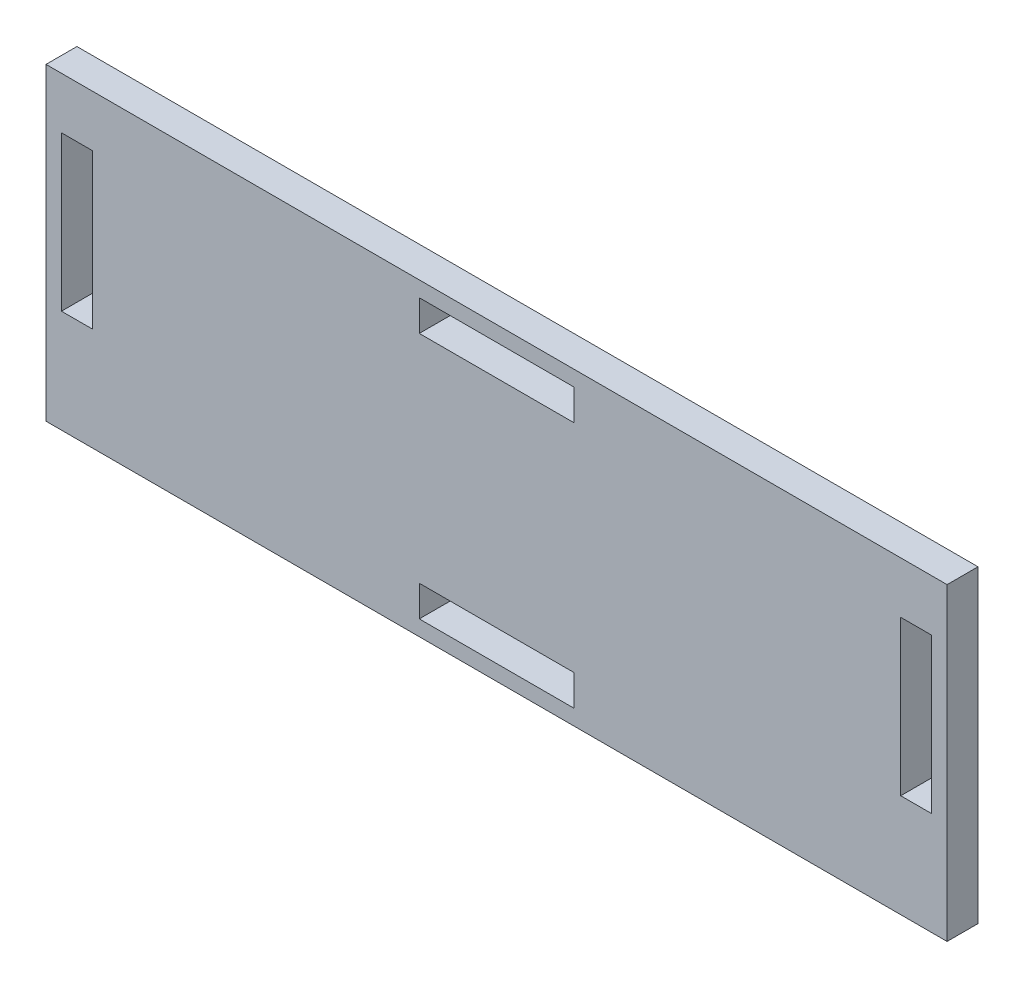
ISO-10303-21;
HEADER;
FILE_DESCRIPTION(('STEP AP214'),'2;1');
FILE_NAME('part.step','',(''),(''),'','','');
FILE_SCHEMA(('AUTOMOTIVE_DESIGN { 1 0 10303 214 1 1 1 1 }'));
ENDSEC;
DATA;
#1=APPLICATION_CONTEXT('core data for automotive mechanical design processes');
#2=APPLICATION_PROTOCOL_DEFINITION('international standard','automotive_design',2000,#1);
#3=PRODUCT_CONTEXT('',#1,'mechanical');
#4=PRODUCT('Part','Part','',(#3));
#5=PRODUCT_RELATED_PRODUCT_CATEGORY('part','',(#4));
#6=PRODUCT_DEFINITION_FORMATION('','',#4);
#7=PRODUCT_DEFINITION_CONTEXT('part definition',#1,'design');
#8=PRODUCT_DEFINITION('design','',#6,#7);
#9=PRODUCT_DEFINITION_SHAPE('','',#8);
#10=(LENGTH_UNIT() NAMED_UNIT(*) SI_UNIT(.MILLI.,.METRE.));
#11=(NAMED_UNIT(*) PLANE_ANGLE_UNIT() SI_UNIT($,.RADIAN.));
#12=(NAMED_UNIT(*) SI_UNIT($,.STERADIAN.) SOLID_ANGLE_UNIT());
#13=UNCERTAINTY_MEASURE_WITH_UNIT(LENGTH_MEASURE(1.E-05),#10,'distance_accuracy_value','');
#14=(GEOMETRIC_REPRESENTATION_CONTEXT(3) GLOBAL_UNCERTAINTY_ASSIGNED_CONTEXT((#13)) GLOBAL_UNIT_ASSIGNED_CONTEXT((#10,
#11,#12)) REPRESENTATION_CONTEXT('',''));
#15=CARTESIAN_POINT('',(0.,0.,0.));
#16=DIRECTION('',(0.,0.,1.));
#17=DIRECTION('',(1.,0.,0.));
#18=AXIS2_PLACEMENT_3D('',#15,#16,#17);
#19=CARTESIAN_POINT('',(0.,0.,3.));
#20=DIRECTION('',(1.,0.,0.));
#21=DIRECTION('',(0.,0.,-1.));
#22=AXIS2_PLACEMENT_3D('',#19,#20,#21);
#23=PLANE('',#22);
#24=DIRECTION('',(0.,-1.,0.));
#25=VECTOR('',#24,1.);
#26=CARTESIAN_POINT('',(0.,0.,0.));
#27=LINE('',#26,#25);
#28=CARTESIAN_POINT('',(0.,30.,0.));
#29=VERTEX_POINT('',#28);
#30=CARTESIAN_POINT('',(0.,0.,0.));
#31=VERTEX_POINT('',#30);
#32=EDGE_CURVE('E295',#29,#31,#27,.T.);
#33=ORIENTED_EDGE('',*,*,#32,.T.);
#34=DIRECTION('',(0.,0.,-1.));
#35=VECTOR('',#34,1.);
#36=CARTESIAN_POINT('',(0.,0.,3.));
#37=LINE('',#36,#35);
#38=CARTESIAN_POINT('',(0.,0.,3.));
#39=VERTEX_POINT('',#38);
#40=EDGE_CURVE('E11',#39,#31,#37,.T.);
#41=ORIENTED_EDGE('',*,*,#40,.F.);
#42=DIRECTION('',(0.,-1.,0.));
#43=VECTOR('',#42,1.);
#44=CARTESIAN_POINT('',(0.,0.,3.));
#45=LINE('',#44,#43);
#46=CARTESIAN_POINT('',(0.,30.,3.));
#47=VERTEX_POINT('',#46);
#48=EDGE_CURVE('E302',#47,#39,#45,.T.);
#49=ORIENTED_EDGE('',*,*,#48,.F.);
#50=DIRECTION('',(0.,0.,-1.));
#51=VECTOR('',#50,1.);
#52=CARTESIAN_POINT('',(0.,30.,3.));
#53=LINE('',#52,#51);
#54=EDGE_CURVE('E312',#47,#29,#53,.T.);
#55=ORIENTED_EDGE('',*,*,#54,.T.);
#56=EDGE_LOOP('',(#33,#41,#49,#55));
#57=FACE_BOUND('',#56,.T.);
#58=ADVANCED_FACE('F33',(#57),#23,.F.);
#59=CARTESIAN_POINT('',(0.,0.,3.));
#60=DIRECTION('',(0.,1.,0.));
#61=DIRECTION('',(0.,0.,1.));
#62=AXIS2_PLACEMENT_3D('',#59,#60,#61);
#63=PLANE('',#62);
#64=DIRECTION('',(1.,0.,0.));
#65=VECTOR('',#64,1.);
#66=CARTESIAN_POINT('',(0.,0.,0.));
#67=LINE('',#66,#65);
#68=CARTESIAN_POINT('',(87.47,0.,0.));
#69=VERTEX_POINT('',#68);
#70=EDGE_CURVE('E315',#31,#69,#67,.T.);
#71=ORIENTED_EDGE('',*,*,#70,.T.);
#72=DIRECTION('',(0.,0.,-1.));
#73=VECTOR('',#72,1.);
#74=CARTESIAN_POINT('',(87.47,0.,3.));
#75=LINE('',#74,#73);
#76=CARTESIAN_POINT('',(87.47,0.,3.));
#77=VERTEX_POINT('',#76);
#78=EDGE_CURVE('E40',#77,#69,#75,.T.);
#79=ORIENTED_EDGE('',*,*,#78,.F.);
#80=DIRECTION('',(1.,0.,0.));
#81=VECTOR('',#80,1.);
#82=CARTESIAN_POINT('',(0.,0.,3.));
#83=LINE('',#82,#81);
#84=EDGE_CURVE('E305',#39,#77,#83,.T.);
#85=ORIENTED_EDGE('',*,*,#84,.F.);
#86=ORIENTED_EDGE('',*,*,#40,.T.);
#87=EDGE_LOOP('',(#71,#79,#85,#86));
#88=FACE_BOUND('',#87,.T.);
#89=ADVANCED_FACE('F344',(#88),#63,.F.);
#90=CARTESIAN_POINT('',(87.47,0.,3.));
#91=DIRECTION('',(-1.,0.,0.));
#92=DIRECTION('',(0.,0.,1.));
#93=AXIS2_PLACEMENT_3D('',#90,#91,#92);
#94=PLANE('',#93);
#95=DIRECTION('',(0.,1.,0.));
#96=VECTOR('',#95,1.);
#97=CARTESIAN_POINT('',(87.47,0.,0.));
#98=LINE('',#97,#96);
#99=CARTESIAN_POINT('',(87.47,30.,0.));
#100=VERTEX_POINT('',#99);
#101=EDGE_CURVE('E317',#69,#100,#98,.T.);
#102=ORIENTED_EDGE('',*,*,#101,.T.);
#103=DIRECTION('',(0.,0.,-1.));
#104=VECTOR('',#103,1.);
#105=CARTESIAN_POINT('',(87.47,30.,3.));
#106=LINE('',#105,#104);
#107=CARTESIAN_POINT('',(87.47,30.,3.));
#108=VERTEX_POINT('',#107);
#109=EDGE_CURVE('E322',#108,#100,#106,.T.);
#110=ORIENTED_EDGE('',*,*,#109,.F.);
#111=DIRECTION('',(0.,1.,0.));
#112=VECTOR('',#111,1.);
#113=CARTESIAN_POINT('',(87.47,0.,3.));
#114=LINE('',#113,#112);
#115=EDGE_CURVE('E308',#77,#108,#114,.T.);
#116=ORIENTED_EDGE('',*,*,#115,.F.);
#117=ORIENTED_EDGE('',*,*,#78,.T.);
#118=EDGE_LOOP('',(#102,#110,#116,#117));
#119=FACE_BOUND('',#118,.T.);
#120=ADVANCED_FACE('F329',(#119),#94,.F.);
#121=CARTESIAN_POINT('',(0.,30.,3.));
#122=DIRECTION('',(0.,-1.,0.));
#123=DIRECTION('',(0.,0.,-1.));
#124=AXIS2_PLACEMENT_3D('',#121,#122,#123);
#125=PLANE('',#124);
#126=DIRECTION('',(-1.,0.,0.));
#127=VECTOR('',#126,1.);
#128=CARTESIAN_POINT('',(0.,30.,0.));
#129=LINE('',#128,#127);
#130=EDGE_CURVE('E306',#100,#29,#129,.T.);
#131=ORIENTED_EDGE('',*,*,#130,.T.);
#132=ORIENTED_EDGE('',*,*,#54,.F.);
#133=DIRECTION('',(-1.,0.,0.));
#134=VECTOR('',#133,1.);
#135=CARTESIAN_POINT('',(0.,30.,3.));
#136=LINE('',#135,#134);
#137=EDGE_CURVE('E310',#108,#47,#136,.T.);
#138=ORIENTED_EDGE('',*,*,#137,.F.);
#139=ORIENTED_EDGE('',*,*,#109,.T.);
#140=EDGE_LOOP('',(#131,#132,#138,#139));
#141=FACE_BOUND('',#140,.T.);
#142=ADVANCED_FACE('F337',(#141),#125,.F.);
#143=CARTESIAN_POINT('',(0.,0.,3.));
#144=DIRECTION('',(0.,0.,-1.));
#145=DIRECTION('',(-1.,0.,0.));
#146=AXIS2_PLACEMENT_3D('',#143,#144,#145);
#147=PLANE('',#146);
#148=DIRECTION('',(1.,0.,0.));
#149=VECTOR('',#148,1.);
#150=CARTESIAN_POINT('',(82.97,10.,3.));
#151=LINE('',#150,#149);
#152=CARTESIAN_POINT('',(82.97,10.,3.));
#153=VERTEX_POINT('',#152);
#154=CARTESIAN_POINT('',(85.97,10.,3.));
#155=VERTEX_POINT('',#154);
#156=EDGE_CURVE('E196',#153,#155,#151,.T.);
#157=ORIENTED_EDGE('',*,*,#156,.F.);
#158=DIRECTION('',(0.,-1.,0.));
#159=VECTOR('',#158,1.);
#160=CARTESIAN_POINT('',(82.97,25.,3.));
#161=LINE('',#160,#159);
#162=CARTESIAN_POINT('',(82.97,25.,3.));
#163=VERTEX_POINT('',#162);
#164=EDGE_CURVE('E47',#163,#153,#161,.T.);
#165=ORIENTED_EDGE('',*,*,#164,.F.);
#166=DIRECTION('',(-1.,0.,0.));
#167=VECTOR('',#166,1.);
#168=CARTESIAN_POINT('',(82.97,25.,3.));
#169=LINE('',#168,#167);
#170=CARTESIAN_POINT('',(85.97,25.,3.));
#171=VERTEX_POINT('',#170);
#172=EDGE_CURVE('E187',#171,#163,#169,.T.);
#173=ORIENTED_EDGE('',*,*,#172,.F.);
#174=DIRECTION('',(0.,1.,0.));
#175=VECTOR('',#174,1.);
#176=CARTESIAN_POINT('',(85.97,25.,3.));
#177=LINE('',#176,#175);
#178=EDGE_CURVE('E190',#155,#171,#177,.T.);
#179=ORIENTED_EDGE('',*,*,#178,.F.);
#180=EDGE_LOOP('',(#157,#165,#173,#179));
#181=FACE_BOUND('',#180,.T.);
#182=DIRECTION('',(1.,0.,0.));
#183=VECTOR('',#182,1.);
#184=CARTESIAN_POINT('',(1.5,10.,3.));
#185=LINE('',#184,#183);
#186=CARTESIAN_POINT('',(1.5,10.,3.));
#187=VERTEX_POINT('',#186);
#188=CARTESIAN_POINT('',(4.5,10.,3.));
#189=VERTEX_POINT('',#188);
#190=EDGE_CURVE('E221',#187,#189,#185,.T.);
#191=ORIENTED_EDGE('',*,*,#190,.F.);
#192=DIRECTION('',(0.,-1.,0.));
#193=VECTOR('',#192,1.);
#194=CARTESIAN_POINT('',(1.5,25.,3.));
#195=LINE('',#194,#193);
#196=CARTESIAN_POINT('',(1.5,25.,3.));
#197=VERTEX_POINT('',#196);
#198=EDGE_CURVE('E202',#197,#187,#195,.T.);
#199=ORIENTED_EDGE('',*,*,#198,.F.);
#200=DIRECTION('',(-1.,0.,0.));
#201=VECTOR('',#200,1.);
#202=CARTESIAN_POINT('',(1.5,25.,3.));
#203=LINE('',#202,#201);
#204=CARTESIAN_POINT('',(4.5,25.,3.));
#205=VERTEX_POINT('',#204);
#206=EDGE_CURVE('E210',#205,#197,#203,.T.);
#207=ORIENTED_EDGE('',*,*,#206,.F.);
#208=DIRECTION('',(0.,1.,0.));
#209=VECTOR('',#208,1.);
#210=CARTESIAN_POINT('',(4.5,25.,3.));
#211=LINE('',#210,#209);
#212=EDGE_CURVE('E224',#189,#205,#211,.T.);
#213=ORIENTED_EDGE('',*,*,#212,.F.);
#214=EDGE_LOOP('',(#191,#199,#207,#213));
#215=FACE_BOUND('',#214,.T.);
#216=DIRECTION('',(1.,0.,0.));
#217=VECTOR('',#216,1.);
#218=CARTESIAN_POINT('',(36.235,1.5,3.));
#219=LINE('',#218,#217);
#220=CARTESIAN_POINT('',(36.235,1.5,3.));
#221=VERTEX_POINT('',#220);
#222=CARTESIAN_POINT('',(51.235,1.5,3.));
#223=VERTEX_POINT('',#222);
#224=EDGE_CURVE('E253',#221,#223,#219,.T.);
#225=ORIENTED_EDGE('',*,*,#224,.F.);
#226=DIRECTION('',(0.,-1.,0.));
#227=VECTOR('',#226,1.);
#228=CARTESIAN_POINT('',(36.235,4.5,3.));
#229=LINE('',#228,#227);
#230=CARTESIAN_POINT('',(36.235,4.5,3.));
#231=VERTEX_POINT('',#230);
#232=EDGE_CURVE('E231',#231,#221,#229,.T.);
#233=ORIENTED_EDGE('',*,*,#232,.F.);
#234=DIRECTION('',(-1.,0.,0.));
#235=VECTOR('',#234,1.);
#236=CARTESIAN_POINT('',(36.235,4.5,3.));
#237=LINE('',#236,#235);
#238=CARTESIAN_POINT('',(51.235,4.5,3.));
#239=VERTEX_POINT('',#238);
#240=EDGE_CURVE('E242',#239,#231,#237,.T.);
#241=ORIENTED_EDGE('',*,*,#240,.F.);
#242=DIRECTION('',(0.,1.,0.));
#243=VECTOR('',#242,1.);
#244=CARTESIAN_POINT('',(51.235,4.5,3.));
#245=LINE('',#244,#243);
#246=EDGE_CURVE('E256',#223,#239,#245,.T.);
#247=ORIENTED_EDGE('',*,*,#246,.F.);
#248=EDGE_LOOP('',(#225,#233,#241,#247));
#249=FACE_BOUND('',#248,.T.);
#250=DIRECTION('',(1.,0.,0.));
#251=VECTOR('',#250,1.);
#252=CARTESIAN_POINT('',(36.235,25.5,3.));
#253=LINE('',#252,#251);
#254=CARTESIAN_POINT('',(36.235,25.5,3.));
#255=VERTEX_POINT('',#254);
#256=CARTESIAN_POINT('',(51.235,25.5,3.));
#257=VERTEX_POINT('',#256);
#258=EDGE_CURVE('E285',#255,#257,#253,.T.);
#259=ORIENTED_EDGE('',*,*,#258,.F.);
#260=DIRECTION('',(0.,-1.,0.));
#261=VECTOR('',#260,1.);
#262=CARTESIAN_POINT('',(36.235,28.5,3.));
#263=LINE('',#262,#261);
#264=CARTESIAN_POINT('',(36.235,28.5,3.));
#265=VERTEX_POINT('',#264);
#266=EDGE_CURVE('E263',#265,#255,#263,.T.);
#267=ORIENTED_EDGE('',*,*,#266,.F.);
#268=DIRECTION('',(-1.,0.,0.));
#269=VECTOR('',#268,1.);
#270=CARTESIAN_POINT('',(36.235,28.5,3.));
#271=LINE('',#270,#269);
#272=CARTESIAN_POINT('',(51.235,28.5,3.));
#273=VERTEX_POINT('',#272);
#274=EDGE_CURVE('E274',#273,#265,#271,.T.);
#275=ORIENTED_EDGE('',*,*,#274,.F.);
#276=DIRECTION('',(0.,1.,0.));
#277=VECTOR('',#276,1.);
#278=CARTESIAN_POINT('',(51.235,28.5,3.));
#279=LINE('',#278,#277);
#280=EDGE_CURVE('E288',#257,#273,#279,.T.);
#281=ORIENTED_EDGE('',*,*,#280,.F.);
#282=EDGE_LOOP('',(#259,#267,#275,#281));
#283=FACE_BOUND('',#282,.T.);
#284=ORIENTED_EDGE('',*,*,#48,.T.);
#285=ORIENTED_EDGE('',*,*,#84,.T.);
#286=ORIENTED_EDGE('',*,*,#115,.T.);
#287=ORIENTED_EDGE('',*,*,#137,.T.);
#288=EDGE_LOOP('',(#284,#285,#286,#287));
#289=FACE_BOUND('',#288,.T.);
#290=ADVANCED_FACE('F343',(#181,#215,#249,#283,#289),#147,.F.);
#291=CARTESIAN_POINT('',(0.,0.,0.));
#292=DIRECTION('',(0.,0.,-1.));
#293=DIRECTION('',(-1.,0.,0.));
#294=AXIS2_PLACEMENT_3D('',#291,#292,#293);
#295=PLANE('',#294);
#296=DIRECTION('',(0.,-1.,0.));
#297=VECTOR('',#296,1.);
#298=CARTESIAN_POINT('',(82.97,25.,0.));
#299=LINE('',#298,#297);
#300=CARTESIAN_POINT('',(82.97,25.,0.));
#301=VERTEX_POINT('',#300);
#302=CARTESIAN_POINT('',(82.97,10.,0.));
#303=VERTEX_POINT('',#302);
#304=EDGE_CURVE('E171',#301,#303,#299,.T.);
#305=ORIENTED_EDGE('',*,*,#304,.T.);
#306=DIRECTION('',(1.,0.,0.));
#307=VECTOR('',#306,1.);
#308=CARTESIAN_POINT('',(82.97,10.,0.));
#309=LINE('',#308,#307);
#310=CARTESIAN_POINT('',(85.97,10.,0.));
#311=VERTEX_POINT('',#310);
#312=EDGE_CURVE('E180',#303,#311,#309,.T.);
#313=ORIENTED_EDGE('',*,*,#312,.T.);
#314=DIRECTION('',(0.,1.,0.));
#315=VECTOR('',#314,1.);
#316=CARTESIAN_POINT('',(85.97,25.,0.));
#317=LINE('',#316,#315);
#318=CARTESIAN_POINT('',(85.97,25.,0.));
#319=VERTEX_POINT('',#318);
#320=EDGE_CURVE('E55',#311,#319,#317,.T.);
#321=ORIENTED_EDGE('',*,*,#320,.T.);
#322=DIRECTION('',(-1.,0.,0.));
#323=VECTOR('',#322,1.);
#324=CARTESIAN_POINT('',(82.97,25.,0.));
#325=LINE('',#324,#323);
#326=EDGE_CURVE('E177',#319,#301,#325,.T.);
#327=ORIENTED_EDGE('',*,*,#326,.T.);
#328=EDGE_LOOP('',(#305,#313,#321,#327));
#329=FACE_BOUND('',#328,.T.);
#330=DIRECTION('',(0.,-1.,0.));
#331=VECTOR('',#330,1.);
#332=CARTESIAN_POINT('',(1.5,25.,0.));
#333=LINE('',#332,#331);
#334=CARTESIAN_POINT('',(1.5,25.,0.));
#335=VERTEX_POINT('',#334);
#336=CARTESIAN_POINT('',(1.5,10.,0.));
#337=VERTEX_POINT('',#336);
#338=EDGE_CURVE('E206',#335,#337,#333,.T.);
#339=ORIENTED_EDGE('',*,*,#338,.T.);
#340=DIRECTION('',(1.,0.,0.));
#341=VECTOR('',#340,1.);
#342=CARTESIAN_POINT('',(1.5,10.,0.));
#343=LINE('',#342,#341);
#344=CARTESIAN_POINT('',(4.5,10.,0.));
#345=VERTEX_POINT('',#344);
#346=EDGE_CURVE('E209',#337,#345,#343,.T.);
#347=ORIENTED_EDGE('',*,*,#346,.T.);
#348=DIRECTION('',(0.,1.,0.));
#349=VECTOR('',#348,1.);
#350=CARTESIAN_POINT('',(4.5,25.,0.));
#351=LINE('',#350,#349);
#352=CARTESIAN_POINT('',(4.5,25.,0.));
#353=VERTEX_POINT('',#352);
#354=EDGE_CURVE('E213',#345,#353,#351,.T.);
#355=ORIENTED_EDGE('',*,*,#354,.T.);
#356=DIRECTION('',(-1.,0.,0.));
#357=VECTOR('',#356,1.);
#358=CARTESIAN_POINT('',(1.5,25.,0.));
#359=LINE('',#358,#357);
#360=EDGE_CURVE('E216',#353,#335,#359,.T.);
#361=ORIENTED_EDGE('',*,*,#360,.T.);
#362=EDGE_LOOP('',(#339,#347,#355,#361));
#363=FACE_BOUND('',#362,.T.);
#364=DIRECTION('',(0.,-1.,0.));
#365=VECTOR('',#364,1.);
#366=CARTESIAN_POINT('',(36.235,4.5,0.));
#367=LINE('',#366,#365);
#368=CARTESIAN_POINT('',(36.235,4.5,0.));
#369=VERTEX_POINT('',#368);
#370=CARTESIAN_POINT('',(36.235,1.5,0.));
#371=VERTEX_POINT('',#370);
#372=EDGE_CURVE('E238',#369,#371,#367,.T.);
#373=ORIENTED_EDGE('',*,*,#372,.T.);
#374=DIRECTION('',(1.,0.,0.));
#375=VECTOR('',#374,1.);
#376=CARTESIAN_POINT('',(36.235,1.5,0.));
#377=LINE('',#376,#375);
#378=CARTESIAN_POINT('',(51.235,1.5,0.));
#379=VERTEX_POINT('',#378);
#380=EDGE_CURVE('E241',#371,#379,#377,.T.);
#381=ORIENTED_EDGE('',*,*,#380,.T.);
#382=DIRECTION('',(0.,1.,0.));
#383=VECTOR('',#382,1.);
#384=CARTESIAN_POINT('',(51.235,4.5,0.));
#385=LINE('',#384,#383);
#386=CARTESIAN_POINT('',(51.235,4.5,0.));
#387=VERTEX_POINT('',#386);
#388=EDGE_CURVE('E245',#379,#387,#385,.T.);
#389=ORIENTED_EDGE('',*,*,#388,.T.);
#390=DIRECTION('',(-1.,0.,0.));
#391=VECTOR('',#390,1.);
#392=CARTESIAN_POINT('',(36.235,4.5,0.));
#393=LINE('',#392,#391);
#394=EDGE_CURVE('E248',#387,#369,#393,.T.);
#395=ORIENTED_EDGE('',*,*,#394,.T.);
#396=EDGE_LOOP('',(#373,#381,#389,#395));
#397=FACE_BOUND('',#396,.T.);
#398=DIRECTION('',(0.,-1.,0.));
#399=VECTOR('',#398,1.);
#400=CARTESIAN_POINT('',(36.235,28.5,0.));
#401=LINE('',#400,#399);
#402=CARTESIAN_POINT('',(36.235,28.5,0.));
#403=VERTEX_POINT('',#402);
#404=CARTESIAN_POINT('',(36.235,25.5,0.));
#405=VERTEX_POINT('',#404);
#406=EDGE_CURVE('E270',#403,#405,#401,.T.);
#407=ORIENTED_EDGE('',*,*,#406,.T.);
#408=DIRECTION('',(1.,0.,0.));
#409=VECTOR('',#408,1.);
#410=CARTESIAN_POINT('',(36.235,25.5,0.));
#411=LINE('',#410,#409);
#412=CARTESIAN_POINT('',(51.235,25.5,0.));
#413=VERTEX_POINT('',#412);
#414=EDGE_CURVE('E273',#405,#413,#411,.T.);
#415=ORIENTED_EDGE('',*,*,#414,.T.);
#416=DIRECTION('',(0.,1.,0.));
#417=VECTOR('',#416,1.);
#418=CARTESIAN_POINT('',(51.235,28.5,0.));
#419=LINE('',#418,#417);
#420=CARTESIAN_POINT('',(51.235,28.5,0.));
#421=VERTEX_POINT('',#420);
#422=EDGE_CURVE('E277',#413,#421,#419,.T.);
#423=ORIENTED_EDGE('',*,*,#422,.T.);
#424=DIRECTION('',(-1.,0.,0.));
#425=VECTOR('',#424,1.);
#426=CARTESIAN_POINT('',(36.235,28.5,0.));
#427=LINE('',#426,#425);
#428=EDGE_CURVE('E280',#421,#403,#427,.T.);
#429=ORIENTED_EDGE('',*,*,#428,.T.);
#430=EDGE_LOOP('',(#407,#415,#423,#429));
#431=FACE_BOUND('',#430,.T.);
#432=ORIENTED_EDGE('',*,*,#32,.F.);
#433=ORIENTED_EDGE('',*,*,#130,.F.);
#434=ORIENTED_EDGE('',*,*,#101,.F.);
#435=ORIENTED_EDGE('',*,*,#70,.F.);
#436=EDGE_LOOP('',(#432,#433,#434,#435));
#437=FACE_BOUND('',#436,.T.);
#438=ADVANCED_FACE('F184',(#329,#363,#397,#431,#437),#295,.T.);
#439=CARTESIAN_POINT('',(36.235,28.5,0.));
#440=DIRECTION('',(-1.,0.,0.));
#441=DIRECTION('',(0.,0.,1.));
#442=AXIS2_PLACEMENT_3D('',#439,#440,#441);
#443=PLANE('',#442);
#444=ORIENTED_EDGE('',*,*,#266,.T.);
#445=DIRECTION('',(0.,0.,1.));
#446=VECTOR('',#445,1.);
#447=CARTESIAN_POINT('',(36.235,25.5,0.));
#448=LINE('',#447,#446);
#449=EDGE_CURVE('E283',#405,#255,#448,.T.);
#450=ORIENTED_EDGE('',*,*,#449,.F.);
#451=ORIENTED_EDGE('',*,*,#406,.F.);
#452=DIRECTION('',(0.,0.,1.));
#453=VECTOR('',#452,1.);
#454=CARTESIAN_POINT('',(36.235,28.5,0.));
#455=LINE('',#454,#453);
#456=EDGE_CURVE('E293',#403,#265,#455,.T.);
#457=ORIENTED_EDGE('',*,*,#456,.T.);
#458=EDGE_LOOP('',(#444,#450,#451,#457));
#459=FACE_BOUND('',#458,.T.);
#460=ADVANCED_FACE('F356',(#459),#443,.F.);
#461=CARTESIAN_POINT('',(36.235,28.5,0.));
#462=DIRECTION('',(0.,1.,0.));
#463=DIRECTION('',(-1.,0.,0.));
#464=AXIS2_PLACEMENT_3D('',#461,#462,#463);
#465=PLANE('',#464);
#466=ORIENTED_EDGE('',*,*,#274,.T.);
#467=ORIENTED_EDGE('',*,*,#456,.F.);
#468=ORIENTED_EDGE('',*,*,#428,.F.);
#469=DIRECTION('',(0.,0.,1.));
#470=VECTOR('',#469,1.);
#471=CARTESIAN_POINT('',(51.235,28.5,0.));
#472=LINE('',#471,#470);
#473=EDGE_CURVE('E296',#421,#273,#472,.T.);
#474=ORIENTED_EDGE('',*,*,#473,.T.);
#475=EDGE_LOOP('',(#466,#467,#468,#474));
#476=FACE_BOUND('',#475,.T.);
#477=ADVANCED_FACE('F362',(#476),#465,.F.);
#478=CARTESIAN_POINT('',(51.235,28.5,0.));
#479=DIRECTION('',(1.,0.,0.));
#480=DIRECTION('',(0.,0.,-1.));
#481=AXIS2_PLACEMENT_3D('',#478,#479,#480);
#482=PLANE('',#481);
#483=ORIENTED_EDGE('',*,*,#280,.T.);
#484=ORIENTED_EDGE('',*,*,#473,.F.);
#485=ORIENTED_EDGE('',*,*,#422,.F.);
#486=DIRECTION('',(0.,0.,1.));
#487=VECTOR('',#486,1.);
#488=CARTESIAN_POINT('',(51.235,25.5,0.));
#489=LINE('',#488,#487);
#490=EDGE_CURVE('E298',#413,#257,#489,.T.);
#491=ORIENTED_EDGE('',*,*,#490,.T.);
#492=EDGE_LOOP('',(#483,#484,#485,#491));
#493=FACE_BOUND('',#492,.T.);
#494=ADVANCED_FACE('F368',(#493),#482,.F.);
#495=CARTESIAN_POINT('',(36.235,25.5,0.));
#496=DIRECTION('',(0.,-1.,0.));
#497=DIRECTION('',(0.,0.,-1.));
#498=AXIS2_PLACEMENT_3D('',#495,#496,#497);
#499=PLANE('',#498);
#500=ORIENTED_EDGE('',*,*,#258,.T.);
#501=ORIENTED_EDGE('',*,*,#490,.F.);
#502=ORIENTED_EDGE('',*,*,#414,.F.);
#503=ORIENTED_EDGE('',*,*,#449,.T.);
#504=EDGE_LOOP('',(#500,#501,#502,#503));
#505=FACE_BOUND('',#504,.T.);
#506=ADVANCED_FACE('F364',(#505),#499,.F.);
#507=CARTESIAN_POINT('',(36.235,4.5,0.));
#508=DIRECTION('',(-1.,0.,0.));
#509=DIRECTION('',(0.,0.,1.));
#510=AXIS2_PLACEMENT_3D('',#507,#508,#509);
#511=PLANE('',#510);
#512=ORIENTED_EDGE('',*,*,#232,.T.);
#513=DIRECTION('',(0.,0.,1.));
#514=VECTOR('',#513,1.);
#515=CARTESIAN_POINT('',(36.235,1.5,0.));
#516=LINE('',#515,#514);
#517=EDGE_CURVE('E251',#371,#221,#516,.T.);
#518=ORIENTED_EDGE('',*,*,#517,.F.);
#519=ORIENTED_EDGE('',*,*,#372,.F.);
#520=DIRECTION('',(0.,0.,1.));
#521=VECTOR('',#520,1.);
#522=CARTESIAN_POINT('',(36.235,4.5,0.));
#523=LINE('',#522,#521);
#524=EDGE_CURVE('E261',#369,#231,#523,.T.);
#525=ORIENTED_EDGE('',*,*,#524,.T.);
#526=EDGE_LOOP('',(#512,#518,#519,#525));
#527=FACE_BOUND('',#526,.T.);
#528=ADVANCED_FACE('F367',(#527),#511,.F.);
#529=CARTESIAN_POINT('',(36.235,4.5,0.));
#530=DIRECTION('',(0.,1.,0.));
#531=DIRECTION('',(-1.,0.,0.));
#532=AXIS2_PLACEMENT_3D('',#529,#530,#531);
#533=PLANE('',#532);
#534=ORIENTED_EDGE('',*,*,#240,.T.);
#535=ORIENTED_EDGE('',*,*,#524,.F.);
#536=ORIENTED_EDGE('',*,*,#394,.F.);
#537=DIRECTION('',(0.,0.,1.));
#538=VECTOR('',#537,1.);
#539=CARTESIAN_POINT('',(51.235,4.5,0.));
#540=LINE('',#539,#538);
#541=EDGE_CURVE('E264',#387,#239,#540,.T.);
#542=ORIENTED_EDGE('',*,*,#541,.T.);
#543=EDGE_LOOP('',(#534,#535,#536,#542));
#544=FACE_BOUND('',#543,.T.);
#545=ADVANCED_FACE('F378',(#544),#533,.F.);
#546=CARTESIAN_POINT('',(51.235,4.5,0.));
#547=DIRECTION('',(1.,0.,0.));
#548=DIRECTION('',(0.,1.,0.));
#549=AXIS2_PLACEMENT_3D('',#546,#547,#548);
#550=PLANE('',#549);
#551=ORIENTED_EDGE('',*,*,#246,.T.);
#552=ORIENTED_EDGE('',*,*,#541,.F.);
#553=ORIENTED_EDGE('',*,*,#388,.F.);
#554=DIRECTION('',(0.,0.,1.));
#555=VECTOR('',#554,1.);
#556=CARTESIAN_POINT('',(51.235,1.5,0.));
#557=LINE('',#556,#555);
#558=EDGE_CURVE('E266',#379,#223,#557,.T.);
#559=ORIENTED_EDGE('',*,*,#558,.T.);
#560=EDGE_LOOP('',(#551,#552,#553,#559));
#561=FACE_BOUND('',#560,.T.);
#562=ADVANCED_FACE('F384',(#561),#550,.F.);
#563=CARTESIAN_POINT('',(36.235,1.5,0.));
#564=DIRECTION('',(0.,-1.,0.));
#565=DIRECTION('',(1.,0.,0.));
#566=AXIS2_PLACEMENT_3D('',#563,#564,#565);
#567=PLANE('',#566);
#568=ORIENTED_EDGE('',*,*,#224,.T.);
#569=ORIENTED_EDGE('',*,*,#558,.F.);
#570=ORIENTED_EDGE('',*,*,#380,.F.);
#571=ORIENTED_EDGE('',*,*,#517,.T.);
#572=EDGE_LOOP('',(#568,#569,#570,#571));
#573=FACE_BOUND('',#572,.T.);
#574=ADVANCED_FACE('F380',(#573),#567,.F.);
#575=CARTESIAN_POINT('',(1.5,25.,0.));
#576=DIRECTION('',(-1.,0.,0.));
#577=DIRECTION('',(0.,-1.,0.));
#578=AXIS2_PLACEMENT_3D('',#575,#576,#577);
#579=PLANE('',#578);
#580=ORIENTED_EDGE('',*,*,#198,.T.);
#581=DIRECTION('',(0.,0.,1.));
#582=VECTOR('',#581,1.);
#583=CARTESIAN_POINT('',(1.5,10.,0.));
#584=LINE('',#583,#582);
#585=EDGE_CURVE('E219',#337,#187,#584,.T.);
#586=ORIENTED_EDGE('',*,*,#585,.F.);
#587=ORIENTED_EDGE('',*,*,#338,.F.);
#588=DIRECTION('',(0.,0.,1.));
#589=VECTOR('',#588,1.);
#590=CARTESIAN_POINT('',(1.5,25.,0.));
#591=LINE('',#590,#589);
#592=EDGE_CURVE('E229',#335,#197,#591,.T.);
#593=ORIENTED_EDGE('',*,*,#592,.T.);
#594=EDGE_LOOP('',(#580,#586,#587,#593));
#595=FACE_BOUND('',#594,.T.);
#596=ADVANCED_FACE('F383',(#595),#579,.F.);
#597=CARTESIAN_POINT('',(1.5,25.,0.));
#598=DIRECTION('',(0.,1.,0.));
#599=DIRECTION('',(-1.,0.,0.));
#600=AXIS2_PLACEMENT_3D('',#597,#598,#599);
#601=PLANE('',#600);
#602=ORIENTED_EDGE('',*,*,#206,.T.);
#603=ORIENTED_EDGE('',*,*,#592,.F.);
#604=ORIENTED_EDGE('',*,*,#360,.F.);
#605=DIRECTION('',(0.,0.,1.));
#606=VECTOR('',#605,1.);
#607=CARTESIAN_POINT('',(4.5,25.,0.));
#608=LINE('',#607,#606);
#609=EDGE_CURVE('E232',#353,#205,#608,.T.);
#610=ORIENTED_EDGE('',*,*,#609,.T.);
#611=EDGE_LOOP('',(#602,#603,#604,#610));
#612=FACE_BOUND('',#611,.T.);
#613=ADVANCED_FACE('F394',(#612),#601,.F.);
#614=CARTESIAN_POINT('',(4.5,25.,0.));
#615=DIRECTION('',(1.,0.,0.));
#616=DIRECTION('',(0.,1.,0.));
#617=AXIS2_PLACEMENT_3D('',#614,#615,#616);
#618=PLANE('',#617);
#619=ORIENTED_EDGE('',*,*,#212,.T.);
#620=ORIENTED_EDGE('',*,*,#609,.F.);
#621=ORIENTED_EDGE('',*,*,#354,.F.);
#622=DIRECTION('',(0.,0.,1.));
#623=VECTOR('',#622,1.);
#624=CARTESIAN_POINT('',(4.5,10.,0.));
#625=LINE('',#624,#623);
#626=EDGE_CURVE('E234',#345,#189,#625,.T.);
#627=ORIENTED_EDGE('',*,*,#626,.T.);
#628=EDGE_LOOP('',(#619,#620,#621,#627));
#629=FACE_BOUND('',#628,.T.);
#630=ADVANCED_FACE('F399',(#629),#618,.F.);
#631=CARTESIAN_POINT('',(1.5,10.,0.));
#632=DIRECTION('',(0.,-1.,0.));
#633=DIRECTION('',(0.,0.,-1.));
#634=AXIS2_PLACEMENT_3D('',#631,#632,#633);
#635=PLANE('',#634);
#636=ORIENTED_EDGE('',*,*,#190,.T.);
#637=ORIENTED_EDGE('',*,*,#626,.F.);
#638=ORIENTED_EDGE('',*,*,#346,.F.);
#639=ORIENTED_EDGE('',*,*,#585,.T.);
#640=EDGE_LOOP('',(#636,#637,#638,#639));
#641=FACE_BOUND('',#640,.T.);
#642=ADVANCED_FACE('F396',(#641),#635,.F.);
#643=CARTESIAN_POINT('',(82.97,25.,0.));
#644=DIRECTION('',(-1.,0.,0.));
#645=DIRECTION('',(0.,0.,1.));
#646=AXIS2_PLACEMENT_3D('',#643,#644,#645);
#647=PLANE('',#646);
#648=ORIENTED_EDGE('',*,*,#164,.T.);
#649=DIRECTION('',(0.,0.,1.));
#650=VECTOR('',#649,1.);
#651=CARTESIAN_POINT('',(82.97,10.,0.));
#652=LINE('',#651,#650);
#653=EDGE_CURVE('E167',#303,#153,#652,.T.);
#654=ORIENTED_EDGE('',*,*,#653,.F.);
#655=ORIENTED_EDGE('',*,*,#304,.F.);
#656=DIRECTION('',(0.,0.,1.));
#657=VECTOR('',#656,1.);
#658=CARTESIAN_POINT('',(82.97,25.,0.));
#659=LINE('',#658,#657);
#660=EDGE_CURVE('E200',#301,#163,#659,.T.);
#661=ORIENTED_EDGE('',*,*,#660,.T.);
#662=EDGE_LOOP('',(#648,#654,#655,#661));
#663=FACE_BOUND('',#662,.T.);
#664=ADVANCED_FACE('F169',(#663),#647,.F.);
#665=CARTESIAN_POINT('',(82.97,25.,0.));
#666=DIRECTION('',(0.,1.,0.));
#667=DIRECTION('',(0.,0.,1.));
#668=AXIS2_PLACEMENT_3D('',#665,#666,#667);
#669=PLANE('',#668);
#670=ORIENTED_EDGE('',*,*,#172,.T.);
#671=ORIENTED_EDGE('',*,*,#660,.F.);
#672=ORIENTED_EDGE('',*,*,#326,.F.);
#673=DIRECTION('',(0.,0.,1.));
#674=VECTOR('',#673,1.);
#675=CARTESIAN_POINT('',(85.97,25.,0.));
#676=LINE('',#675,#674);
#677=EDGE_CURVE('E203',#319,#171,#676,.T.);
#678=ORIENTED_EDGE('',*,*,#677,.T.);
#679=EDGE_LOOP('',(#670,#671,#672,#678));
#680=FACE_BOUND('',#679,.T.);
#681=ADVANCED_FACE('F409',(#680),#669,.F.);
#682=CARTESIAN_POINT('',(85.97,25.,0.));
#683=DIRECTION('',(1.,0.,0.));
#684=DIRECTION('',(0.,0.,-1.));
#685=AXIS2_PLACEMENT_3D('',#682,#683,#684);
#686=PLANE('',#685);
#687=ORIENTED_EDGE('',*,*,#178,.T.);
#688=ORIENTED_EDGE('',*,*,#677,.F.);
#689=ORIENTED_EDGE('',*,*,#320,.F.);
#690=DIRECTION('',(0.,0.,1.));
#691=VECTOR('',#690,1.);
#692=CARTESIAN_POINT('',(85.97,10.,0.));
#693=LINE('',#692,#691);
#694=EDGE_CURVE('E176',#311,#155,#693,.T.);
#695=ORIENTED_EDGE('',*,*,#694,.T.);
#696=EDGE_LOOP('',(#687,#688,#689,#695));
#697=FACE_BOUND('',#696,.T.);
#698=ADVANCED_FACE('F412',(#697),#686,.F.);
#699=CARTESIAN_POINT('',(82.97,10.,0.));
#700=DIRECTION('',(0.,-1.,0.));
#701=DIRECTION('',(0.,0.,-1.));
#702=AXIS2_PLACEMENT_3D('',#699,#700,#701);
#703=PLANE('',#702);
#704=ORIENTED_EDGE('',*,*,#156,.T.);
#705=ORIENTED_EDGE('',*,*,#694,.F.);
#706=ORIENTED_EDGE('',*,*,#312,.F.);
#707=ORIENTED_EDGE('',*,*,#653,.T.);
#708=EDGE_LOOP('',(#704,#705,#706,#707));
#709=FACE_BOUND('',#708,.T.);
#710=ADVANCED_FACE('F181',(#709),#703,.F.);
#711=CLOSED_SHELL('',(#58,#89,#120,#142,#290,#438,#460,#477,#494,#506,#528,#545,#562,#574,#596,
#613,#630,#642,#664,#681,#698,#710));
#712=MANIFOLD_SOLID_BREP('B2',#711);
#713=ADVANCED_BREP_SHAPE_REPRESENTATION('',(#18,#712),#14);
#714=SHAPE_DEFINITION_REPRESENTATION(#9,#713);
ENDSEC;
END-ISO-10303-21;
